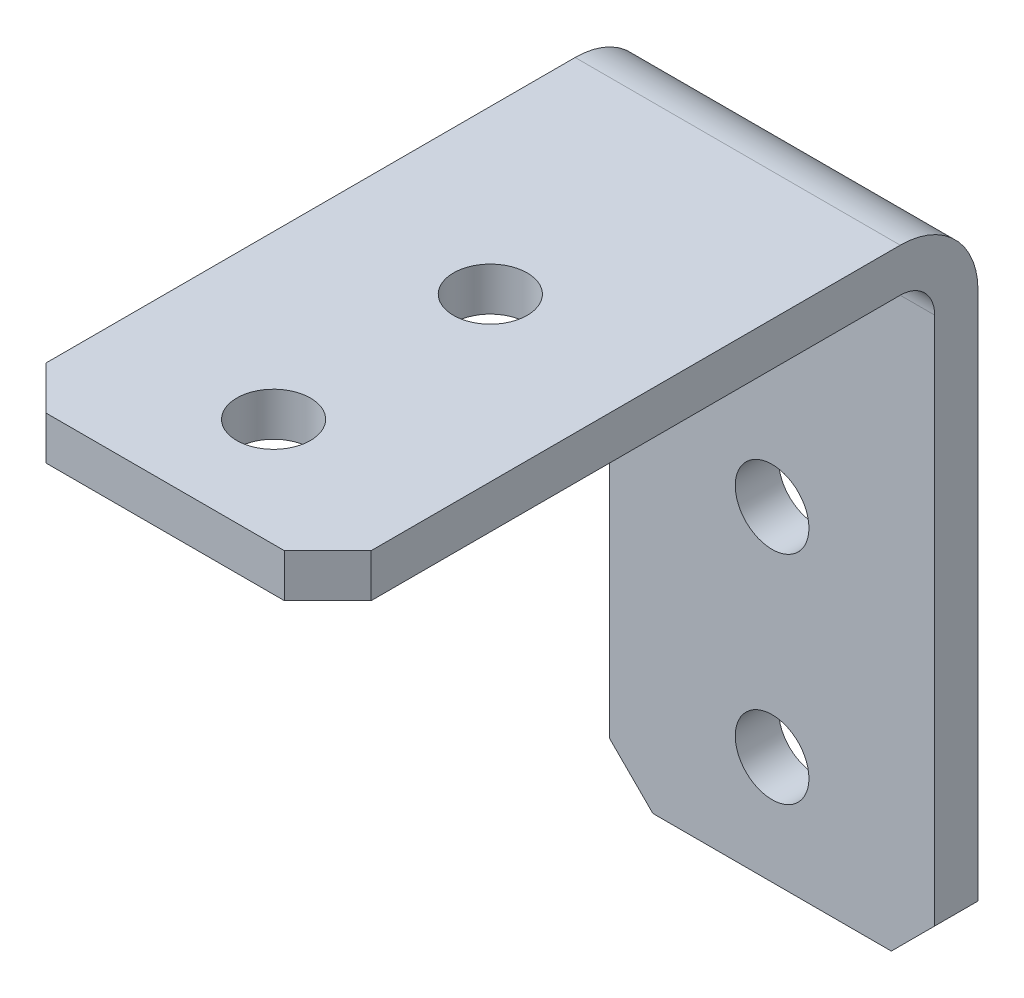
ISO-10303-21;
HEADER;
FILE_DESCRIPTION(('STEP AP214'),'2;1');
FILE_NAME('part.step','',(''),(''),'','','');
FILE_SCHEMA(('AUTOMOTIVE_DESIGN { 1 0 10303 214 1 1 1 1 }'));
ENDSEC;
DATA;
#1=APPLICATION_CONTEXT('core data for automotive mechanical design processes');
#2=APPLICATION_PROTOCOL_DEFINITION('international standard','automotive_design',2000,#1);
#3=PRODUCT_CONTEXT('',#1,'mechanical');
#4=PRODUCT('Part','Part','',(#3));
#5=PRODUCT_RELATED_PRODUCT_CATEGORY('part','',(#4));
#6=PRODUCT_DEFINITION_FORMATION('','',#4);
#7=PRODUCT_DEFINITION_CONTEXT('part definition',#1,'design');
#8=PRODUCT_DEFINITION('design','',#6,#7);
#9=PRODUCT_DEFINITION_SHAPE('','',#8);
#10=(LENGTH_UNIT() NAMED_UNIT(*) SI_UNIT(.MILLI.,.METRE.));
#11=(NAMED_UNIT(*) PLANE_ANGLE_UNIT() SI_UNIT($,.RADIAN.));
#12=(NAMED_UNIT(*) SI_UNIT($,.STERADIAN.) SOLID_ANGLE_UNIT());
#13=UNCERTAINTY_MEASURE_WITH_UNIT(LENGTH_MEASURE(1.E-05),#10,'distance_accuracy_value','');
#14=(GEOMETRIC_REPRESENTATION_CONTEXT(3) GLOBAL_UNCERTAINTY_ASSIGNED_CONTEXT((#13)) GLOBAL_UNIT_ASSIGNED_CONTEXT((#10,
#11,#12)) REPRESENTATION_CONTEXT('',''));
#15=CARTESIAN_POINT('',(0.,0.,0.));
#16=DIRECTION('',(0.,0.,1.));
#17=DIRECTION('',(1.,0.,0.));
#18=AXIS2_PLACEMENT_3D('',#15,#16,#17);
#19=CARTESIAN_POINT('',(7.5,15.,-2.));
#20=DIRECTION('',(0.,0.,-1.));
#21=DIRECTION('',(-1.,0.,0.));
#22=AXIS2_PLACEMENT_3D('',#19,#20,#21);
#23=PLANE('',#22);
#24=CARTESIAN_POINT('',(0.,0.,-2.));
#25=DIRECTION('',(0.,0.,1.));
#26=DIRECTION('',(1.,0.,0.));
#27=AXIS2_PLACEMENT_3D('',#24,#25,#26);
#28=CIRCLE('',#27,1.69999999999999);
#29=CARTESIAN_POINT('',(1.69999999999999,0.,-2.));
#30=VERTEX_POINT('',#29);
#31=EDGE_CURVE('E241',#30,#30,#28,.T.);
#32=ORIENTED_EDGE('',*,*,#31,.T.);
#33=EDGE_LOOP('',(#32));
#34=FACE_BOUND('',#33,.T.);
#35=CARTESIAN_POINT('',(0.,-9.99999999999999,-2.));
#36=DIRECTION('',(0.,0.,1.));
#37=DIRECTION('',(1.,0.,0.));
#38=AXIS2_PLACEMENT_3D('',#35,#36,#37);
#39=CIRCLE('',#38,1.69999999999999);
#40=CARTESIAN_POINT('',(1.69999999999999,-9.99999999999999,-2.));
#41=VERTEX_POINT('',#40);
#42=EDGE_CURVE('E233',#41,#41,#39,.T.);
#43=ORIENTED_EDGE('',*,*,#42,.T.);
#44=EDGE_LOOP('',(#43));
#45=FACE_BOUND('',#44,.T.);
#46=DIRECTION('',(0.,-1.,0.));
#47=VECTOR('',#46,1.);
#48=CARTESIAN_POINT('',(-7.5,15.,-2.));
#49=LINE('',#48,#47);
#50=CARTESIAN_POINT('',(-7.5,11.4125,-2.));
#51=VERTEX_POINT('',#50);
#52=CARTESIAN_POINT('',(-7.5,-13.,-2.));
#53=VERTEX_POINT('',#52);
#54=EDGE_CURVE('E152',#51,#53,#49,.T.);
#55=ORIENTED_EDGE('',*,*,#54,.F.);
#56=DIRECTION('',(-1.,0.,0.));
#57=VECTOR('',#56,1.);
#58=CARTESIAN_POINT('',(7.5,11.4125,-2.));
#59=LINE('',#58,#57);
#60=CARTESIAN_POINT('',(7.5,11.4125,-2.));
#61=VERTEX_POINT('',#60);
#62=EDGE_CURVE('E52',#51,#61,#59,.F.);
#63=ORIENTED_EDGE('',*,*,#62,.T.);
#64=DIRECTION('',(0.,-1.,0.));
#65=VECTOR('',#64,1.);
#66=CARTESIAN_POINT('',(7.5,15.,-2.));
#67=LINE('',#66,#65);
#68=CARTESIAN_POINT('',(7.50000000000001,-13.,-2.));
#69=VERTEX_POINT('',#68);
#70=EDGE_CURVE('E220',#61,#69,#67,.T.);
#71=ORIENTED_EDGE('',*,*,#70,.T.);
#72=DIRECTION('',(-0.707106781186543,-0.707106781186552,0.));
#73=VECTOR('',#72,1.);
#74=CARTESIAN_POINT('',(21.5,1.00000000000019,-2.));
#75=LINE('',#74,#73);
#76=CARTESIAN_POINT('',(5.50000000000002,-15.,-2.));
#77=VERTEX_POINT('',#76);
#78=EDGE_CURVE('E175',#69,#77,#75,.T.);
#79=ORIENTED_EDGE('',*,*,#78,.T.);
#80=DIRECTION('',(-1.,0.,0.));
#81=VECTOR('',#80,1.);
#82=CARTESIAN_POINT('',(7.5,-15.,-2.));
#83=LINE('',#82,#81);
#84=CARTESIAN_POINT('',(-5.49999999999997,-15.,-2.));
#85=VERTEX_POINT('',#84);
#86=EDGE_CURVE('E163',#77,#85,#83,.T.);
#87=ORIENTED_EDGE('',*,*,#86,.T.);
#88=DIRECTION('',(0.707106781186552,-0.707106781186543,0.));
#89=VECTOR('',#88,1.);
#90=CARTESIAN_POINT('',(-13.9999999999999,-6.50000000000019,-2.));
#91=LINE('',#90,#89);
#92=EDGE_CURVE('E158',#85,#53,#91,.F.);
#93=ORIENTED_EDGE('',*,*,#92,.T.);
#94=EDGE_LOOP('',(#55,#63,#71,#79,#87,#93));
#95=FACE_BOUND('',#94,.T.);
#96=ADVANCED_FACE('F44',(#34,#45,#95),#23,.T.);
#97=CARTESIAN_POINT('',(7.5,15.0000000000001,28.));
#98=DIRECTION('',(0.,1.,0.));
#99=DIRECTION('',(0.,0.,1.));
#100=AXIS2_PLACEMENT_3D('',#97,#98,#99);
#101=PLANE('',#100);
#102=CARTESIAN_POINT('',(0.,15.0000000000002,13.));
#103=DIRECTION('',(0.,-1.,0.));
#104=DIRECTION('',(0.,0.,-1.));
#105=AXIS2_PLACEMENT_3D('',#102,#103,#104);
#106=CIRCLE('',#105,1.69999999999999);
#107=CARTESIAN_POINT('',(0.,15.0000000000002,11.3));
#108=VERTEX_POINT('',#107);
#109=EDGE_CURVE('E253',#108,#108,#106,.T.);
#110=ORIENTED_EDGE('',*,*,#109,.T.);
#111=EDGE_LOOP('',(#110));
#112=FACE_BOUND('',#111,.T.);
#113=CARTESIAN_POINT('',(0.,15.0000000000002,23.));
#114=DIRECTION('',(0.,-1.,0.));
#115=DIRECTION('',(0.,0.,-1.));
#116=AXIS2_PLACEMENT_3D('',#113,#114,#115);
#117=CIRCLE('',#116,1.69999999999999);
#118=CARTESIAN_POINT('',(0.,15.0000000000002,21.3));
#119=VERTEX_POINT('',#118);
#120=EDGE_CURVE('E247',#119,#119,#117,.T.);
#121=ORIENTED_EDGE('',*,*,#120,.T.);
#122=EDGE_LOOP('',(#121));
#123=FACE_BOUND('',#122,.T.);
#124=DIRECTION('',(0.,0.,-1.));
#125=VECTOR('',#124,1.);
#126=CARTESIAN_POINT('',(7.5,15.0000000000001,28.));
#127=LINE('',#126,#125);
#128=CARTESIAN_POINT('',(7.5,15.0000000000001,26.));
#129=VERTEX_POINT('',#128);
#130=CARTESIAN_POINT('',(7.5,15.,1.58749999999999));
#131=VERTEX_POINT('',#130);
#132=EDGE_CURVE('E215',#129,#131,#127,.T.);
#133=ORIENTED_EDGE('',*,*,#132,.T.);
#134=DIRECTION('',(-1.,0.,0.));
#135=VECTOR('',#134,1.);
#136=CARTESIAN_POINT('',(7.5,15.,1.58749999999999));
#137=LINE('',#136,#135);
#138=CARTESIAN_POINT('',(-7.5,15.,1.58749999999999));
#139=VERTEX_POINT('',#138);
#140=EDGE_CURVE('E205',#131,#139,#137,.T.);
#141=ORIENTED_EDGE('',*,*,#140,.T.);
#142=DIRECTION('',(0.,0.,-1.));
#143=VECTOR('',#142,1.);
#144=CARTESIAN_POINT('',(-7.5,15.0000000000001,28.));
#145=LINE('',#144,#143);
#146=CARTESIAN_POINT('',(-7.5,15.0000000000001,26.));
#147=VERTEX_POINT('',#146);
#148=EDGE_CURVE('E213',#147,#139,#145,.T.);
#149=ORIENTED_EDGE('',*,*,#148,.F.);
#150=DIRECTION('',(-0.707106781186551,0.,-0.707106781186544));
#151=VECTOR('',#150,1.);
#152=CARTESIAN_POINT('',(1.00000000000007,15.0000000000001,34.5));
#153=LINE('',#152,#151);
#154=CARTESIAN_POINT('',(-5.49999999999999,15.0000000000001,28.));
#155=VERTEX_POINT('',#154);
#156=EDGE_CURVE('E184',#147,#155,#153,.F.);
#157=ORIENTED_EDGE('',*,*,#156,.T.);
#158=DIRECTION('',(-1.,0.,0.));
#159=VECTOR('',#158,1.);
#160=CARTESIAN_POINT('',(7.5,15.0000000000001,28.));
#161=LINE('',#160,#159);
#162=CARTESIAN_POINT('',(5.50000000000001,15.0000000000001,28.));
#163=VERTEX_POINT('',#162);
#164=EDGE_CURVE('E159',#163,#155,#161,.T.);
#165=ORIENTED_EDGE('',*,*,#164,.F.);
#166=DIRECTION('',(0.707106781186543,0.,-0.707106781186552));
#167=VECTOR('',#166,1.);
#168=CARTESIAN_POINT('',(6.49999999999999,15.0000000000001,27.));
#169=LINE('',#168,#167);
#170=EDGE_CURVE('E182',#163,#129,#169,.T.);
#171=ORIENTED_EDGE('',*,*,#170,.T.);
#172=EDGE_LOOP('',(#133,#141,#149,#157,#165,#171));
#173=FACE_BOUND('',#172,.T.);
#174=ADVANCED_FACE('F212',(#112,#123,#173),#101,.T.);
#175=CARTESIAN_POINT('',(7.5,-15.,28.0000000000001));
#176=DIRECTION('',(0.,0.,1.));
#177=DIRECTION('',(0.,-1.,0.));
#178=AXIS2_PLACEMENT_3D('',#175,#176,#177);
#179=PLANE('',#178);
#180=ORIENTED_EDGE('',*,*,#164,.T.);
#181=DIRECTION('',(0.,-1.,0.));
#182=VECTOR('',#181,1.);
#183=CARTESIAN_POINT('',(-5.49999999999999,-15.,28.0000000000001));
#184=LINE('',#183,#182);
#185=CARTESIAN_POINT('',(-5.49999999999999,13.0000000000001,28.));
#186=VERTEX_POINT('',#185);
#187=EDGE_CURVE('E189',#155,#186,#184,.T.);
#188=ORIENTED_EDGE('',*,*,#187,.T.);
#189=DIRECTION('',(1.,0.,0.));
#190=VECTOR('',#189,1.);
#191=CARTESIAN_POINT('',(-7.50000000000001,13.0000000000001,28.));
#192=LINE('',#191,#190);
#193=CARTESIAN_POINT('',(5.50000000000001,13.0000000000001,28.));
#194=VERTEX_POINT('',#193);
#195=EDGE_CURVE('E153',#186,#194,#192,.T.);
#196=ORIENTED_EDGE('',*,*,#195,.T.);
#197=DIRECTION('',(0.,1.,0.));
#198=VECTOR('',#197,1.);
#199=CARTESIAN_POINT('',(5.50000000000001,15.0000000000001,28.));
#200=LINE('',#199,#198);
#201=EDGE_CURVE('E186',#194,#163,#200,.T.);
#202=ORIENTED_EDGE('',*,*,#201,.T.);
#203=EDGE_LOOP('',(#180,#188,#196,#202));
#204=FACE_BOUND('',#203,.T.);
#205=ADVANCED_FACE('F295',(#204),#179,.T.);
#206=CARTESIAN_POINT('',(7.5,-15.,-2.));
#207=DIRECTION('',(0.,-1.,0.));
#208=DIRECTION('',(1.,0.,0.));
#209=AXIS2_PLACEMENT_3D('',#206,#207,#208);
#210=PLANE('',#209);
#211=ORIENTED_EDGE('',*,*,#86,.F.);
#212=DIRECTION('',(0.,0.,1.));
#213=VECTOR('',#212,1.);
#214=CARTESIAN_POINT('',(5.50000000000002,-15.,0.));
#215=LINE('',#214,#213);
#216=CARTESIAN_POINT('',(5.50000000000002,-15.,0.));
#217=VERTEX_POINT('',#216);
#218=EDGE_CURVE('E143',#77,#217,#215,.T.);
#219=ORIENTED_EDGE('',*,*,#218,.T.);
#220=DIRECTION('',(1.,0.,0.));
#221=VECTOR('',#220,1.);
#222=CARTESIAN_POINT('',(-7.5,-15.,0.));
#223=LINE('',#222,#221);
#224=CARTESIAN_POINT('',(-5.49999999999997,-15.,0.));
#225=VERTEX_POINT('',#224);
#226=EDGE_CURVE('E135',#225,#217,#223,.T.);
#227=ORIENTED_EDGE('',*,*,#226,.F.);
#228=DIRECTION('',(0.,0.,-1.));
#229=VECTOR('',#228,1.);
#230=CARTESIAN_POINT('',(-5.49999999999997,-15.,-2.));
#231=LINE('',#230,#229);
#232=EDGE_CURVE('E149',#225,#85,#231,.T.);
#233=ORIENTED_EDGE('',*,*,#232,.T.);
#234=EDGE_LOOP('',(#211,#219,#227,#233));
#235=FACE_BOUND('',#234,.T.);
#236=ADVANCED_FACE('F148',(#235),#210,.T.);
#237=CARTESIAN_POINT('',(7.5,0.,0.));
#238=DIRECTION('',(-1.,0.,0.));
#239=DIRECTION('',(0.,-1.,0.));
#240=AXIS2_PLACEMENT_3D('',#237,#238,#239);
#241=PLANE('',#240);
#242=ORIENTED_EDGE('',*,*,#70,.F.);
#243=CARTESIAN_POINT('',(7.5,11.4125,1.5875));
#244=DIRECTION('',(-1.,0.,0.));
#245=DIRECTION('',(0.,-1.,0.));
#246=AXIS2_PLACEMENT_3D('',#243,#244,#245);
#247=CIRCLE('',#246,3.5875);
#248=EDGE_CURVE('E13',#61,#131,#247,.F.);
#249=ORIENTED_EDGE('',*,*,#248,.T.);
#250=ORIENTED_EDGE('',*,*,#132,.F.);
#251=DIRECTION('',(0.,-1.,0.));
#252=VECTOR('',#251,1.);
#253=CARTESIAN_POINT('',(7.5,13.0000000000001,26.));
#254=LINE('',#253,#252);
#255=CARTESIAN_POINT('',(7.5,13.0000000000001,26.));
#256=VERTEX_POINT('',#255);
#257=EDGE_CURVE('E168',#129,#256,#254,.T.);
#258=ORIENTED_EDGE('',*,*,#257,.T.);
#259=DIRECTION('',(0.,0.,1.));
#260=VECTOR('',#259,1.);
#261=CARTESIAN_POINT('',(7.5,13.,0.));
#262=LINE('',#261,#260);
#263=CARTESIAN_POINT('',(7.5,13.,1.5875));
#264=VERTEX_POINT('',#263);
#265=EDGE_CURVE('E229',#264,#256,#262,.T.);
#266=ORIENTED_EDGE('',*,*,#265,.F.);
#267=CARTESIAN_POINT('',(7.5,11.4125,1.5875));
#268=DIRECTION('',(-1.,0.,0.));
#269=DIRECTION('',(0.,-1.,0.));
#270=AXIS2_PLACEMENT_3D('',#267,#268,#269);
#271=CIRCLE('',#270,1.5875);
#272=CARTESIAN_POINT('',(7.5,11.4125,0.));
#273=VERTEX_POINT('',#272);
#274=EDGE_CURVE('E201',#264,#273,#271,.T.);
#275=ORIENTED_EDGE('',*,*,#274,.T.);
#276=DIRECTION('',(0.,1.,0.));
#277=VECTOR('',#276,1.);
#278=CARTESIAN_POINT('',(7.5,-15.,0.));
#279=LINE('',#278,#277);
#280=CARTESIAN_POINT('',(7.5,-13.,0.));
#281=VERTEX_POINT('',#280);
#282=EDGE_CURVE('E231',#281,#273,#279,.T.);
#283=ORIENTED_EDGE('',*,*,#282,.F.);
#284=DIRECTION('',(0.,0.,-1.));
#285=VECTOR('',#284,1.);
#286=CARTESIAN_POINT('',(7.5,-13.,-2.));
#287=LINE('',#286,#285);
#288=EDGE_CURVE('E171',#281,#69,#287,.T.);
#289=ORIENTED_EDGE('',*,*,#288,.T.);
#290=EDGE_LOOP('',(#242,#249,#250,#258,#266,#275,#283,#289));
#291=FACE_BOUND('',#290,.T.);
#292=ADVANCED_FACE('F280',(#291),#241,.F.);
#293=CARTESIAN_POINT('',(-7.5,0.,0.));
#294=DIRECTION('',(-1.,0.,0.));
#295=DIRECTION('',(0.,-1.,0.));
#296=AXIS2_PLACEMENT_3D('',#293,#294,#295);
#297=PLANE('',#296);
#298=ORIENTED_EDGE('',*,*,#148,.T.);
#299=CARTESIAN_POINT('',(-7.5,11.4125,1.5875));
#300=DIRECTION('',(-1.,0.,0.));
#301=DIRECTION('',(0.,-1.,0.));
#302=AXIS2_PLACEMENT_3D('',#299,#300,#301);
#303=CIRCLE('',#302,3.5875);
#304=EDGE_CURVE('E66',#139,#51,#303,.T.);
#305=ORIENTED_EDGE('',*,*,#304,.T.);
#306=ORIENTED_EDGE('',*,*,#54,.T.);
#307=DIRECTION('',(0.,0.,1.));
#308=VECTOR('',#307,1.);
#309=CARTESIAN_POINT('',(-7.5,-13.,0.));
#310=LINE('',#309,#308);
#311=CARTESIAN_POINT('',(-7.5,-13.,0.));
#312=VERTEX_POINT('',#311);
#313=EDGE_CURVE('E177',#53,#312,#310,.T.);
#314=ORIENTED_EDGE('',*,*,#313,.T.);
#315=DIRECTION('',(0.,1.,0.));
#316=VECTOR('',#315,1.);
#317=CARTESIAN_POINT('',(-7.5,-15.,0.));
#318=LINE('',#317,#316);
#319=CARTESIAN_POINT('',(-7.50000000000001,11.4125,0.));
#320=VERTEX_POINT('',#319);
#321=EDGE_CURVE('E137',#312,#320,#318,.T.);
#322=ORIENTED_EDGE('',*,*,#321,.T.);
#323=CARTESIAN_POINT('',(-7.5,11.4125,1.5875));
#324=DIRECTION('',(-1.,0.,0.));
#325=DIRECTION('',(0.,-1.,0.));
#326=AXIS2_PLACEMENT_3D('',#323,#324,#325);
#327=CIRCLE('',#326,1.5875);
#328=CARTESIAN_POINT('',(-7.50000000000001,13.,1.5875));
#329=VERTEX_POINT('',#328);
#330=EDGE_CURVE('E203',#320,#329,#327,.F.);
#331=ORIENTED_EDGE('',*,*,#330,.T.);
#332=DIRECTION('',(0.,0.,1.));
#333=VECTOR('',#332,1.);
#334=CARTESIAN_POINT('',(-7.50000000000001,13.,0.));
#335=LINE('',#334,#333);
#336=CARTESIAN_POINT('',(-7.50000000000001,13.0000000000001,26.));
#337=VERTEX_POINT('',#336);
#338=EDGE_CURVE('E227',#329,#337,#335,.T.);
#339=ORIENTED_EDGE('',*,*,#338,.T.);
#340=DIRECTION('',(0.,1.,0.));
#341=VECTOR('',#340,1.);
#342=CARTESIAN_POINT('',(-7.5,0.,26.0000000000001));
#343=LINE('',#342,#341);
#344=EDGE_CURVE('E179',#337,#147,#343,.T.);
#345=ORIENTED_EDGE('',*,*,#344,.T.);
#346=EDGE_LOOP('',(#298,#305,#306,#314,#322,#331,#339,#345));
#347=FACE_BOUND('',#346,.T.);
#348=ADVANCED_FACE('F218',(#347),#297,.T.);
#349=CARTESIAN_POINT('',(-7.5,-15.,0.));
#350=DIRECTION('',(0.,0.,-1.));
#351=DIRECTION('',(-1.,0.,0.));
#352=AXIS2_PLACEMENT_3D('',#349,#350,#351);
#353=PLANE('',#352);
#354=CARTESIAN_POINT('',(0.,0.,0.));
#355=DIRECTION('',(0.,0.,1.));
#356=DIRECTION('',(1.,0.,0.));
#357=AXIS2_PLACEMENT_3D('',#354,#355,#356);
#358=CIRCLE('',#357,1.69999999999999);
#359=CARTESIAN_POINT('',(1.69999999999999,0.,0.));
#360=VERTEX_POINT('',#359);
#361=EDGE_CURVE('E244',#360,#360,#358,.T.);
#362=ORIENTED_EDGE('',*,*,#361,.F.);
#363=EDGE_LOOP('',(#362));
#364=FACE_BOUND('',#363,.T.);
#365=CARTESIAN_POINT('',(0.,-9.99999999999999,0.));
#366=DIRECTION('',(0.,0.,1.));
#367=DIRECTION('',(1.,0.,0.));
#368=AXIS2_PLACEMENT_3D('',#365,#366,#367);
#369=CIRCLE('',#368,1.69999999999999);
#370=CARTESIAN_POINT('',(1.69999999999999,-9.99999999999999,0.));
#371=VERTEX_POINT('',#370);
#372=EDGE_CURVE('E238',#371,#371,#369,.T.);
#373=ORIENTED_EDGE('',*,*,#372,.F.);
#374=EDGE_LOOP('',(#373));
#375=FACE_BOUND('',#374,.T.);
#376=ORIENTED_EDGE('',*,*,#282,.T.);
#377=DIRECTION('',(1.,0.,0.));
#378=VECTOR('',#377,1.);
#379=CARTESIAN_POINT('',(-7.50000000000001,11.4125,0.));
#380=LINE('',#379,#378);
#381=EDGE_CURVE('E199',#273,#320,#380,.F.);
#382=ORIENTED_EDGE('',*,*,#381,.T.);
#383=ORIENTED_EDGE('',*,*,#321,.F.);
#384=DIRECTION('',(-0.707106781186552,0.707106781186543,0.));
#385=VECTOR('',#384,1.);
#386=CARTESIAN_POINT('',(-7.5,-13.,0.));
#387=LINE('',#386,#385);
#388=EDGE_CURVE('E131',#312,#225,#387,.F.);
#389=ORIENTED_EDGE('',*,*,#388,.T.);
#390=ORIENTED_EDGE('',*,*,#226,.T.);
#391=DIRECTION('',(0.707106781186543,0.707106781186552,0.));
#392=VECTOR('',#391,1.);
#393=CARTESIAN_POINT('',(5.50000000000002,-15.,0.));
#394=LINE('',#393,#392);
#395=EDGE_CURVE('E142',#217,#281,#394,.T.);
#396=ORIENTED_EDGE('',*,*,#395,.T.);
#397=EDGE_LOOP('',(#376,#382,#383,#389,#390,#396));
#398=FACE_BOUND('',#397,.T.);
#399=ADVANCED_FACE('F134',(#364,#375,#398),#353,.F.);
#400=CARTESIAN_POINT('',(-7.50000000000001,13.,0.));
#401=DIRECTION('',(0.,1.,0.));
#402=DIRECTION('',(0.,0.,1.));
#403=AXIS2_PLACEMENT_3D('',#400,#401,#402);
#404=PLANE('',#403);
#405=CARTESIAN_POINT('',(0.,13.,13.));
#406=DIRECTION('',(0.,-1.,0.));
#407=DIRECTION('',(0.,0.,-1.));
#408=AXIS2_PLACEMENT_3D('',#405,#406,#407);
#409=CIRCLE('',#408,1.69999999999999);
#410=CARTESIAN_POINT('',(0.,13.,11.3));
#411=VERTEX_POINT('',#410);
#412=EDGE_CURVE('E256',#411,#411,#409,.T.);
#413=ORIENTED_EDGE('',*,*,#412,.F.);
#414=EDGE_LOOP('',(#413));
#415=FACE_BOUND('',#414,.T.);
#416=CARTESIAN_POINT('',(0.,13.0000000000001,23.));
#417=DIRECTION('',(0.,-1.,0.));
#418=DIRECTION('',(0.,0.,-1.));
#419=AXIS2_PLACEMENT_3D('',#416,#417,#418);
#420=CIRCLE('',#419,1.69999999999999);
#421=CARTESIAN_POINT('',(0.,13.0000000000001,21.3));
#422=VERTEX_POINT('',#421);
#423=EDGE_CURVE('E250',#422,#422,#420,.T.);
#424=ORIENTED_EDGE('',*,*,#423,.F.);
#425=EDGE_LOOP('',(#424));
#426=FACE_BOUND('',#425,.T.);
#427=ORIENTED_EDGE('',*,*,#338,.F.);
#428=DIRECTION('',(1.,0.,0.));
#429=VECTOR('',#428,1.);
#430=CARTESIAN_POINT('',(7.5,13.,1.5875));
#431=LINE('',#430,#429);
#432=EDGE_CURVE('E196',#329,#264,#431,.T.);
#433=ORIENTED_EDGE('',*,*,#432,.T.);
#434=ORIENTED_EDGE('',*,*,#265,.T.);
#435=DIRECTION('',(-0.707106781186543,0.,0.707106781186552));
#436=VECTOR('',#435,1.);
#437=CARTESIAN_POINT('',(5.50000000000001,13.0000000000001,28.));
#438=LINE('',#437,#436);
#439=EDGE_CURVE('E191',#256,#194,#438,.T.);
#440=ORIENTED_EDGE('',*,*,#439,.T.);
#441=ORIENTED_EDGE('',*,*,#195,.F.);
#442=DIRECTION('',(0.707106781186551,0.,0.707106781186544));
#443=VECTOR('',#442,1.);
#444=CARTESIAN_POINT('',(-7.5,13.0000000000001,26.));
#445=LINE('',#444,#443);
#446=EDGE_CURVE('E193',#186,#337,#445,.F.);
#447=ORIENTED_EDGE('',*,*,#446,.T.);
#448=EDGE_LOOP('',(#427,#433,#434,#440,#441,#447));
#449=FACE_BOUND('',#448,.T.);
#450=ADVANCED_FACE('F262',(#415,#426,#449),#404,.F.);
#451=CARTESIAN_POINT('',(0.,-9.99999999999999,0.));
#452=DIRECTION('',(0.,0.,1.));
#453=DIRECTION('',(1.,0.,0.));
#454=AXIS2_PLACEMENT_3D('',#451,#452,#453);
#455=CYLINDRICAL_SURFACE('',#454,1.69999999999999);
#456=ORIENTED_EDGE('',*,*,#42,.F.);
#457=EDGE_LOOP('',(#456));
#458=FACE_BOUND('',#457,.T.);
#459=ORIENTED_EDGE('',*,*,#372,.T.);
#460=EDGE_LOOP('',(#459));
#461=FACE_BOUND('',#460,.T.);
#462=ADVANCED_FACE('F265',(#458,#461),#455,.F.);
#463=CARTESIAN_POINT('',(0.,0.,0.));
#464=DIRECTION('',(0.,0.,1.));
#465=DIRECTION('',(1.,0.,0.));
#466=AXIS2_PLACEMENT_3D('',#463,#464,#465);
#467=CYLINDRICAL_SURFACE('',#466,1.69999999999999);
#468=ORIENTED_EDGE('',*,*,#31,.F.);
#469=EDGE_LOOP('',(#468));
#470=FACE_BOUND('',#469,.T.);
#471=ORIENTED_EDGE('',*,*,#361,.T.);
#472=EDGE_LOOP('',(#471));
#473=FACE_BOUND('',#472,.T.);
#474=ADVANCED_FACE('F374',(#470,#473),#467,.F.);
#475=CARTESIAN_POINT('',(0.,13.0000000000001,23.));
#476=DIRECTION('',(0.,-1.,0.));
#477=DIRECTION('',(0.,0.,-1.));
#478=AXIS2_PLACEMENT_3D('',#475,#476,#477);
#479=CYLINDRICAL_SURFACE('',#478,1.69999999999999);
#480=ORIENTED_EDGE('',*,*,#120,.F.);
#481=EDGE_LOOP('',(#480));
#482=FACE_BOUND('',#481,.T.);
#483=ORIENTED_EDGE('',*,*,#423,.T.);
#484=EDGE_LOOP('',(#483));
#485=FACE_BOUND('',#484,.T.);
#486=ADVANCED_FACE('F382',(#482,#485),#479,.F.);
#487=CARTESIAN_POINT('',(0.,13.0000000000001,13.));
#488=DIRECTION('',(0.,-1.,0.));
#489=DIRECTION('',(0.,0.,-1.));
#490=AXIS2_PLACEMENT_3D('',#487,#488,#489);
#491=CYLINDRICAL_SURFACE('',#490,1.69999999999999);
#492=ORIENTED_EDGE('',*,*,#109,.F.);
#493=EDGE_LOOP('',(#492));
#494=FACE_BOUND('',#493,.T.);
#495=ORIENTED_EDGE('',*,*,#412,.T.);
#496=EDGE_LOOP('',(#495));
#497=FACE_BOUND('',#496,.T.);
#498=ADVANCED_FACE('F260',(#494,#497),#491,.F.);
#499=CARTESIAN_POINT('',(5.50000000000002,-15.,-2.));
#500=DIRECTION('',(0.707106781186552,-0.707106781186543,0.));
#501=DIRECTION('',(0.,0.,-1.));
#502=AXIS2_PLACEMENT_3D('',#499,#500,#501);
#503=PLANE('',#502);
#504=ORIENTED_EDGE('',*,*,#78,.F.);
#505=ORIENTED_EDGE('',*,*,#288,.F.);
#506=ORIENTED_EDGE('',*,*,#395,.F.);
#507=ORIENTED_EDGE('',*,*,#218,.F.);
#508=EDGE_LOOP('',(#504,#505,#506,#507));
#509=FACE_BOUND('',#508,.T.);
#510=ADVANCED_FACE('F284',(#509),#503,.T.);
#511=CARTESIAN_POINT('',(-7.5,0.,26.0000000000001));
#512=DIRECTION('',(0.707106781186544,0.,-0.707106781186551));
#513=DIRECTION('',(0.,1.,0.));
#514=AXIS2_PLACEMENT_3D('',#511,#512,#513);
#515=PLANE('',#514);
#516=ORIENTED_EDGE('',*,*,#446,.F.);
#517=ORIENTED_EDGE('',*,*,#187,.F.);
#518=ORIENTED_EDGE('',*,*,#156,.F.);
#519=ORIENTED_EDGE('',*,*,#344,.F.);
#520=EDGE_LOOP('',(#516,#517,#518,#519));
#521=FACE_BOUND('',#520,.T.);
#522=ADVANCED_FACE('F304',(#521),#515,.F.);
#523=CARTESIAN_POINT('',(5.50000000000002,-15.,28.0000000000001));
#524=DIRECTION('',(0.707106781186552,0.,0.707106781186543));
#525=DIRECTION('',(0.,-1.,0.));
#526=AXIS2_PLACEMENT_3D('',#523,#524,#525);
#527=PLANE('',#526);
#528=ORIENTED_EDGE('',*,*,#439,.F.);
#529=ORIENTED_EDGE('',*,*,#257,.F.);
#530=ORIENTED_EDGE('',*,*,#170,.F.);
#531=ORIENTED_EDGE('',*,*,#201,.F.);
#532=EDGE_LOOP('',(#528,#529,#530,#531));
#533=FACE_BOUND('',#532,.T.);
#534=ADVANCED_FACE('F307',(#533),#527,.T.);
#535=CARTESIAN_POINT('',(-7.5,-13.,0.));
#536=DIRECTION('',(0.707106781186543,0.707106781186552,0.));
#537=DIRECTION('',(0.,0.,1.));
#538=AXIS2_PLACEMENT_3D('',#535,#536,#537);
#539=PLANE('',#538);
#540=ORIENTED_EDGE('',*,*,#92,.F.);
#541=ORIENTED_EDGE('',*,*,#232,.F.);
#542=ORIENTED_EDGE('',*,*,#388,.F.);
#543=ORIENTED_EDGE('',*,*,#313,.F.);
#544=EDGE_LOOP('',(#540,#541,#542,#543));
#545=FACE_BOUND('',#544,.T.);
#546=ADVANCED_FACE('F156',(#545),#539,.F.);
#547=CARTESIAN_POINT('',(-7.50000000000001,11.4125,1.5875));
#548=DIRECTION('',(-1.,0.,0.));
#549=DIRECTION('',(0.,-1.,0.));
#550=AXIS2_PLACEMENT_3D('',#547,#548,#549);
#551=CYLINDRICAL_SURFACE('',#550,1.5875);
#552=ORIENTED_EDGE('',*,*,#330,.F.);
#553=ORIENTED_EDGE('',*,*,#381,.F.);
#554=ORIENTED_EDGE('',*,*,#274,.F.);
#555=ORIENTED_EDGE('',*,*,#432,.F.);
#556=EDGE_LOOP('',(#552,#553,#554,#555));
#557=FACE_BOUND('',#556,.T.);
#558=ADVANCED_FACE('F276',(#557),#551,.F.);
#559=CARTESIAN_POINT('',(7.5,11.4125,1.5875));
#560=DIRECTION('',(-1.,0.,0.));
#561=DIRECTION('',(0.,-1.,0.));
#562=AXIS2_PLACEMENT_3D('',#559,#560,#561);
#563=CYLINDRICAL_SURFACE('',#562,3.5875);
#564=ORIENTED_EDGE('',*,*,#248,.F.);
#565=ORIENTED_EDGE('',*,*,#62,.F.);
#566=ORIENTED_EDGE('',*,*,#304,.F.);
#567=ORIENTED_EDGE('',*,*,#140,.F.);
#568=EDGE_LOOP('',(#564,#565,#566,#567));
#569=FACE_BOUND('',#568,.T.);
#570=ADVANCED_FACE('F46',(#569),#563,.T.);
#571=CLOSED_SHELL('',(#96,#174,#205,#236,#292,#348,#399,#450,#462,#474,#486,#498,#510,#522,#534,
#546,#558,#570));
#572=MANIFOLD_SOLID_BREP('B2',#571);
#573=ADVANCED_BREP_SHAPE_REPRESENTATION('',(#18,#572),#14);
#574=SHAPE_DEFINITION_REPRESENTATION(#9,#573);
ENDSEC;
END-ISO-10303-21;
